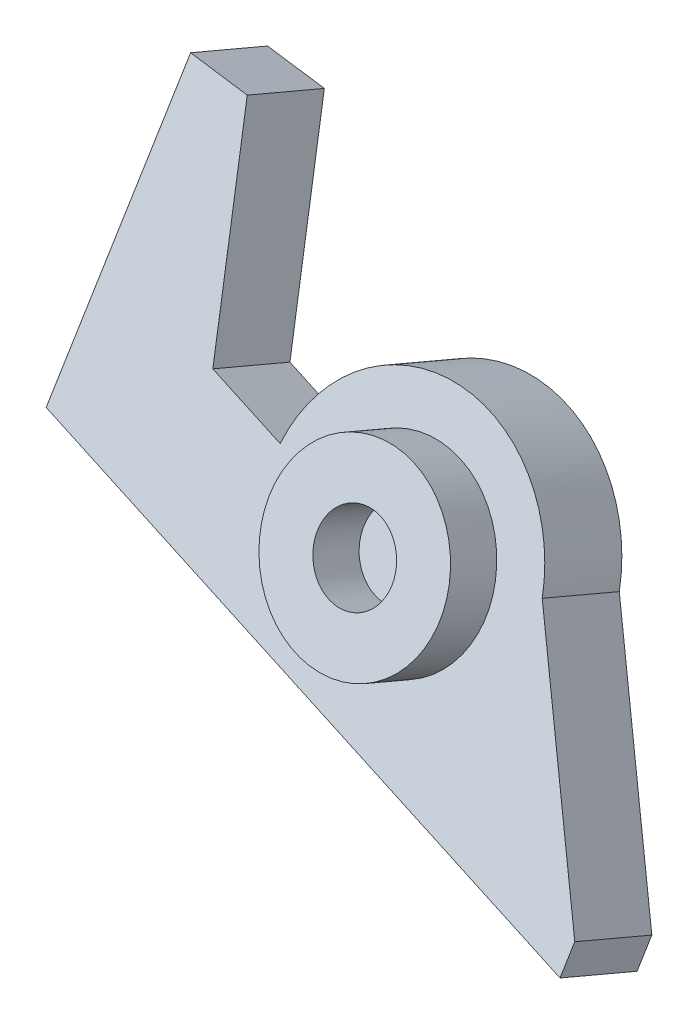
ISO-10303-21;
HEADER;
FILE_DESCRIPTION(('STEP AP214'),'2;1');
FILE_NAME('part.step','',(''),(''),'','','');
FILE_SCHEMA(('AUTOMOTIVE_DESIGN { 1 0 10303 214 1 1 1 1 }'));
ENDSEC;
DATA;
#1=APPLICATION_CONTEXT('core data for automotive mechanical design processes');
#2=APPLICATION_PROTOCOL_DEFINITION('international standard','automotive_design',2000,#1);
#3=PRODUCT_CONTEXT('',#1,'mechanical');
#4=PRODUCT('Part','Part','',(#3));
#5=PRODUCT_RELATED_PRODUCT_CATEGORY('part','',(#4));
#6=PRODUCT_DEFINITION_FORMATION('','',#4);
#7=PRODUCT_DEFINITION_CONTEXT('part definition',#1,'design');
#8=PRODUCT_DEFINITION('design','',#6,#7);
#9=PRODUCT_DEFINITION_SHAPE('','',#8);
#10=(LENGTH_UNIT() NAMED_UNIT(*) SI_UNIT(.MILLI.,.METRE.));
#11=(NAMED_UNIT(*) PLANE_ANGLE_UNIT() SI_UNIT($,.RADIAN.));
#12=(NAMED_UNIT(*) SI_UNIT($,.STERADIAN.) SOLID_ANGLE_UNIT());
#13=UNCERTAINTY_MEASURE_WITH_UNIT(LENGTH_MEASURE(1.E-05),#10,'distance_accuracy_value','');
#14=(GEOMETRIC_REPRESENTATION_CONTEXT(3) GLOBAL_UNCERTAINTY_ASSIGNED_CONTEXT((#13)) GLOBAL_UNIT_ASSIGNED_CONTEXT((#10,
#11,#12)) REPRESENTATION_CONTEXT('',''));
#15=CARTESIAN_POINT('',(0.,0.,0.));
#16=DIRECTION('',(0.,0.,1.));
#17=DIRECTION('',(1.,0.,0.));
#18=AXIS2_PLACEMENT_3D('',#15,#16,#17);
#19=CARTESIAN_POINT('',(14.8125805376239,-8.48935887369528,308.826969749882));
#20=DIRECTION('',(-0.994161271701165,0.0993265508240584,-0.0421616194057797));
#21=DIRECTION('',(-0.0994149502409714,-0.995046063088833,0.));
#22=AXIS2_PLACEMENT_3D('',#19,#20,#21);
#23=PLANE('',#22);
#24=DIRECTION('',(0.107904429239592,0.915130275715367,-0.388449755592142));
#25=VECTOR('',#24,1.);
#26=CARTESIAN_POINT('',(14.8125805376239,-10.4430145161416,304.22444548262));
#27=LINE('',#26,#25);
#28=CARTESIAN_POINT('',(14.6209854962964,-12.0679192974498,304.914176641024));
#29=VERTEX_POINT('',#28);
#30=CARTESIAN_POINT('',(14.8125805376239,-10.4430145161416,304.22444548262));
#31=VERTEX_POINT('',#30);
#32=EDGE_CURVE('E138',#29,#31,#27,.T.);
#33=ORIENTED_EDGE('',*,*,#32,.T.);
#34=DIRECTION('',(0.,-0.390731128489272,-0.920504853452441));
#35=VECTOR('',#34,1.);
#36=CARTESIAN_POINT('',(14.8125805376239,-8.48935887369528,308.826969749882));
#37=LINE('',#36,#35);
#38=CARTESIAN_POINT('',(14.8125805376239,-8.48935887369528,308.826969749882));
#39=VERTEX_POINT('',#38);
#40=EDGE_CURVE('E49',#39,#31,#37,.T.);
#41=ORIENTED_EDGE('',*,*,#40,.F.);
#42=DIRECTION('',(0.107904429239592,0.915130275715367,-0.388449755592142));
#43=VECTOR('',#42,1.);
#44=CARTESIAN_POINT('',(14.8125805376239,-8.48935887369528,308.826969749882));
#45=LINE('',#44,#43);
#46=CARTESIAN_POINT('',(14.6209854962964,-10.1142636550035,309.516700908286));
#47=VERTEX_POINT('',#46);
#48=EDGE_CURVE('E153',#47,#39,#45,.T.);
#49=ORIENTED_EDGE('',*,*,#48,.F.);
#50=DIRECTION('',(0.,-0.390731128489272,-0.920504853452441));
#51=VECTOR('',#50,1.);
#52=CARTESIAN_POINT('',(14.6209854962964,-10.1142636550035,309.516700908286));
#53=LINE('',#52,#51);
#54=EDGE_CURVE('E134',#47,#29,#53,.T.);
#55=ORIENTED_EDGE('',*,*,#54,.T.);
#56=EDGE_LOOP('',(#33,#41,#49,#55));
#57=FACE_BOUND('',#56,.T.);
#58=ADVANCED_FACE('F41',(#57),#23,.F.);
#59=CARTESIAN_POINT('',(7.86559114317784,3.29791646067198,303.823568218714));
#60=DIRECTION('',(-0.87898063015439,-0.438949620480405,0.186323059478691));
#61=DIRECTION('',(0.446773275951896,-0.894647215328596,0.));
#62=AXIS2_PLACEMENT_3D('',#59,#60,#61);
#63=PLANE('',#62);
#64=DIRECTION('',(-0.476857475367003,0.809105936147801,-0.343445093540436));
#65=VECTOR('',#64,1.);
#66=CARTESIAN_POINT('',(7.86559114317786,1.34426081822563,299.221043951452));
#67=LINE('',#66,#65);
#68=CARTESIAN_POINT('',(7.86559114317762,1.3442608182256,299.221043951452));
#69=VERTEX_POINT('',#68);
#70=EDGE_CURVE('E141',#31,#69,#67,.T.);
#71=ORIENTED_EDGE('',*,*,#70,.T.);
#72=DIRECTION('',(0.,-0.390731128489272,-0.920504853452441));
#73=VECTOR('',#72,1.);
#74=CARTESIAN_POINT('',(7.86559114317761,3.29791646067196,303.823568218714));
#75=LINE('',#74,#73);
#76=CARTESIAN_POINT('',(7.86559114317761,3.29791646067196,303.823568218714));
#77=VERTEX_POINT('',#76);
#78=EDGE_CURVE('E163',#77,#69,#75,.T.);
#79=ORIENTED_EDGE('',*,*,#78,.F.);
#80=DIRECTION('',(-0.476857475367003,0.809105936147801,-0.343445093540436));
#81=VECTOR('',#80,1.);
#82=CARTESIAN_POINT('',(7.86559114317784,3.29791646067198,303.823568218714));
#83=LINE('',#82,#81);
#84=EDGE_CURVE('E101',#39,#77,#83,.T.);
#85=ORIENTED_EDGE('',*,*,#84,.F.);
#86=ORIENTED_EDGE('',*,*,#40,.T.);
#87=EDGE_LOOP('',(#71,#79,#85,#86));
#88=FACE_BOUND('',#87,.T.);
#89=ADVANCED_FACE('F166',(#88),#63,.F.);
#90=CARTESIAN_POINT('',(-1.39659253553726E-13,1.95370326151105,304.394152869375));
#91=DIRECTION('',(0.,-0.390731128489272,-0.920504853452441));
#92=DIRECTION('',(0.,0.920504853452441,-0.390731128489272));
#93=AXIS2_PLACEMENT_3D('',#90,#91,#92);
#94=CYLINDRICAL_SURFACE('',#93,8.00000000000023);
#95=CARTESIAN_POINT('',(-1.2220184685951E-13,4.76190646914176E-05,299.791628602112));
#96=DIRECTION('',(0.,0.390731128489272,0.920504853452441));
#97=DIRECTION('',(0.,-0.920504853452441,0.390731128489272));
#98=AXIS2_PLACEMENT_3D('',#95,#96,#97);
#99=CIRCLE('',#98,8.00000000000023);
#100=CARTESIAN_POINT('',(-7.8393144027153,1.46857736601409,299.168274707678));
#101=VERTEX_POINT('',#100);
#102=EDGE_CURVE('E144',#69,#101,#99,.T.);
#103=ORIENTED_EDGE('',*,*,#102,.T.);
#104=DIRECTION('',(0.,-0.390731128489272,-0.920504853452441));
#105=VECTOR('',#104,1.);
#106=CARTESIAN_POINT('',(-7.83931440271532,3.42223300846045,303.77079897494));
#107=LINE('',#106,#105);
#108=CARTESIAN_POINT('',(-7.83931440271532,3.42223300846045,303.77079897494));
#109=VERTEX_POINT('',#108);
#110=EDGE_CURVE('E160',#109,#101,#107,.T.);
#111=ORIENTED_EDGE('',*,*,#110,.F.);
#112=CARTESIAN_POINT('',(-1.39659253553726E-13,1.95370326151105,304.394152869375));
#113=DIRECTION('',(0.,0.390731128489272,0.920504853452441));
#114=DIRECTION('',(0.,-0.920504853452441,0.390731128489272));
#115=AXIS2_PLACEMENT_3D('',#112,#113,#114);
#116=CIRCLE('',#115,8.00000000000023);
#117=EDGE_CURVE('E184',#77,#109,#116,.T.);
#118=ORIENTED_EDGE('',*,*,#117,.F.);
#119=ORIENTED_EDGE('',*,*,#78,.T.);
#120=EDGE_LOOP('',(#103,#111,#118,#119));
#121=FACE_BOUND('',#120,.T.);
#122=ADVANCED_FACE('F177',(#121),#94,.T.);
#123=CARTESIAN_POINT('',(-12.4126653241043,4.72505991857454,303.217781761716));
#124=DIRECTION('',(-0.295641511693019,-0.879357326088254,0.373265039373878));
#125=DIRECTION('',(0.,-0.390731128489271,-0.920504853452442));
#126=AXIS2_PLACEMENT_3D('',#123,#124,#125);
#127=PLANE('',#126);
#128=DIRECTION('',(-0.955298956643347,0.272139446395441,-0.115516341492086));
#129=VECTOR('',#128,1.);
#130=CARTESIAN_POINT('',(-12.4126653241042,2.77140427612818,298.615257494454));
#131=LINE('',#130,#129);
#132=CARTESIAN_POINT('',(-12.4126653241042,2.77140427612818,298.615257494454));
#133=VERTEX_POINT('',#132);
#134=EDGE_CURVE('E146',#101,#133,#131,.T.);
#135=ORIENTED_EDGE('',*,*,#134,.T.);
#136=DIRECTION('',(0.,-0.390731128489272,-0.920504853452441));
#137=VECTOR('',#136,1.);
#138=CARTESIAN_POINT('',(-12.4126653241043,4.72505991857454,303.217781761716));
#139=LINE('',#138,#137);
#140=CARTESIAN_POINT('',(-12.4126653241043,4.72505991857454,303.217781761716));
#141=VERTEX_POINT('',#140);
#142=EDGE_CURVE('E157',#141,#133,#139,.T.);
#143=ORIENTED_EDGE('',*,*,#142,.F.);
#144=DIRECTION('',(-0.955298956643347,0.272139446395441,-0.115516341492086));
#145=VECTOR('',#144,1.);
#146=CARTESIAN_POINT('',(-12.4126653241043,4.72505991857454,303.217781761716));
#147=LINE('',#146,#145);
#148=EDGE_CURVE('E183',#109,#141,#147,.T.);
#149=ORIENTED_EDGE('',*,*,#148,.F.);
#150=ORIENTED_EDGE('',*,*,#110,.T.);
#151=EDGE_LOOP('',(#135,#143,#149,#150));
#152=FACE_BOUND('',#151,.T.);
#153=ADVANCED_FACE('F181',(#152),#127,.F.);
#154=CARTESIAN_POINT('',(-14.8812929025772,15.3857892239627,298.692570649151));
#155=DIRECTION('',(-0.978028487517335,-0.19189883171222,0.0814562213218783));
#156=DIRECTION('',(0.192538652948244,-0.981289390099004,0.));
#157=AXIS2_PLACEMENT_3D('',#154,#155,#156);
#158=PLANE('',#157);
#159=DIRECTION('',(-0.208471287242521,0.900279969574456,-0.382146174622307));
#160=VECTOR('',#159,1.);
#161=CARTESIAN_POINT('',(-14.8812929025772,13.4321335815163,294.090046381889));
#162=LINE('',#161,#160);
#163=CARTESIAN_POINT('',(-14.8812929025772,13.4321335815163,294.090046381889));
#164=VERTEX_POINT('',#163);
#165=EDGE_CURVE('E148',#133,#164,#162,.T.);
#166=ORIENTED_EDGE('',*,*,#165,.T.);
#167=DIRECTION('',(0.,-0.390731128489272,-0.920504853452441));
#168=VECTOR('',#167,1.);
#169=CARTESIAN_POINT('',(-14.8812929025772,15.3857892239627,298.692570649151));
#170=LINE('',#169,#168);
#171=CARTESIAN_POINT('',(-14.8812929025772,15.3857892239627,298.692570649151));
#172=VERTEX_POINT('',#171);
#173=EDGE_CURVE('E129',#172,#164,#170,.T.);
#174=ORIENTED_EDGE('',*,*,#173,.F.);
#175=DIRECTION('',(-0.208471287242521,0.900279969574456,-0.382146174622307));
#176=VECTOR('',#175,1.);
#177=CARTESIAN_POINT('',(-14.8812929025772,15.3857892239627,298.692570649151));
#178=LINE('',#177,#176);
#179=EDGE_CURVE('E120',#141,#172,#178,.T.);
#180=ORIENTED_EDGE('',*,*,#179,.F.);
#181=ORIENTED_EDGE('',*,*,#142,.T.);
#182=EDGE_LOOP('',(#166,#174,#180,#181));
#183=FACE_BOUND('',#182,.T.);
#184=ADVANCED_FACE('F229',(#183),#158,.F.);
#185=CARTESIAN_POINT('',(-18.4128173068375,15.7386234654594,298.54280139934));
#186=DIRECTION('',(-0.107904429239589,-0.915130275715374,0.388449755592125));
#187=DIRECTION('',(0.,-0.390731128489271,-0.920504853452441));
#188=AXIS2_PLACEMENT_3D('',#185,#186,#187);
#189=PLANE('',#188);
#190=DIRECTION('',(-0.994161271701166,0.0993265508240564,-0.0421616194057765));
#191=VECTOR('',#190,1.);
#192=CARTESIAN_POINT('',(-18.4128173068375,13.7849678230131,293.940277132077));
#193=LINE('',#192,#191);
#194=CARTESIAN_POINT('',(-18.4128173068375,13.7849678230131,293.940277132077));
#195=VERTEX_POINT('',#194);
#196=EDGE_CURVE('E128',#164,#195,#193,.T.);
#197=ORIENTED_EDGE('',*,*,#196,.T.);
#198=DIRECTION('',(0.,-0.390731128489272,-0.920504853452441));
#199=VECTOR('',#198,1.);
#200=CARTESIAN_POINT('',(-18.4128173068375,15.7386234654594,298.54280139934));
#201=LINE('',#200,#199);
#202=CARTESIAN_POINT('',(-18.4128173068375,15.7386234654594,298.54280139934));
#203=VERTEX_POINT('',#202);
#204=EDGE_CURVE('E125',#203,#195,#201,.T.);
#205=ORIENTED_EDGE('',*,*,#204,.F.);
#206=DIRECTION('',(-0.994161271701166,0.0993265508240564,-0.0421616194057765));
#207=VECTOR('',#206,1.);
#208=CARTESIAN_POINT('',(-18.4128173068375,15.7386234654594,298.54280139934));
#209=LINE('',#208,#207);
#210=EDGE_CURVE('E114',#172,#203,#209,.T.);
#211=ORIENTED_EDGE('',*,*,#210,.F.);
#212=ORIENTED_EDGE('',*,*,#173,.T.);
#213=EDGE_LOOP('',(#197,#205,#211,#212));
#214=FACE_BOUND('',#213,.T.);
#215=ADVANCED_FACE('F126',(#214),#189,.F.);
#216=CARTESIAN_POINT('',(-18.4128173068375,15.7386234654594,298.54280139934));
#217=DIRECTION('',(0.994161271701165,-0.0993265508240594,0.0421616194057801));
#218=DIRECTION('',(0.0994149502409724,0.995046063088832,0.));
#219=AXIS2_PLACEMENT_3D('',#216,#217,#218);
#220=PLANE('',#219);
#221=DIRECTION('',(-0.107904429239593,-0.915130275715374,0.388449755592125));
#222=VECTOR('',#221,1.);
#223=CARTESIAN_POINT('',(-18.4128173068375,13.7849678230131,293.940277132077));
#224=LINE('',#223,#222);
#225=CARTESIAN_POINT('',(-20.2885634953037,-2.12311063789697,300.69285581302));
#226=VERTEX_POINT('',#225);
#227=EDGE_CURVE('E86',#195,#226,#224,.T.);
#228=ORIENTED_EDGE('',*,*,#227,.T.);
#229=DIRECTION('',(0.,-0.390731128489272,-0.920504853452441));
#230=VECTOR('',#229,1.);
#231=CARTESIAN_POINT('',(-20.2885634953037,-0.169454995450611,305.295380080282));
#232=LINE('',#231,#230);
#233=CARTESIAN_POINT('',(-20.2885634953037,-0.169454995450611,305.295380080282));
#234=VERTEX_POINT('',#233);
#235=EDGE_CURVE('E130',#234,#226,#232,.T.);
#236=ORIENTED_EDGE('',*,*,#235,.F.);
#237=DIRECTION('',(-0.107904429239593,-0.915130275715374,0.388449755592125));
#238=VECTOR('',#237,1.);
#239=CARTESIAN_POINT('',(-18.4128173068375,15.7386234654594,298.54280139934));
#240=LINE('',#239,#238);
#241=EDGE_CURVE('E118',#203,#234,#240,.T.);
#242=ORIENTED_EDGE('',*,*,#241,.F.);
#243=ORIENTED_EDGE('',*,*,#204,.T.);
#244=EDGE_LOOP('',(#228,#236,#242,#243));
#245=FACE_BOUND('',#244,.T.);
#246=ADVANCED_FACE('F132',(#245),#220,.F.);
#247=CARTESIAN_POINT('',(-20.2885634953037,-0.169454995450611,305.295380080282));
#248=DIRECTION('',(0.29564151169302,0.879357326088254,-0.373265039373877));
#249=DIRECTION('',(0.,0.390731128489271,0.920504853452442));
#250=AXIS2_PLACEMENT_3D('',#247,#248,#249);
#251=PLANE('',#250);
#252=DIRECTION('',(0.955298956643346,-0.27213944639544,0.115516341492092));
#253=VECTOR('',#252,1.);
#254=CARTESIAN_POINT('',(-20.2885634953037,-2.12311063789697,300.69285581302));
#255=LINE('',#254,#253);
#256=EDGE_CURVE('E92',#226,#29,#255,.T.);
#257=ORIENTED_EDGE('',*,*,#256,.T.);
#258=ORIENTED_EDGE('',*,*,#54,.F.);
#259=DIRECTION('',(0.955298956643346,-0.27213944639544,0.115516341492092));
#260=VECTOR('',#259,1.);
#261=CARTESIAN_POINT('',(-20.2885634953037,-0.169454995450611,305.295380080282));
#262=LINE('',#261,#260);
#263=EDGE_CURVE('E57',#234,#47,#262,.T.);
#264=ORIENTED_EDGE('',*,*,#263,.F.);
#265=ORIENTED_EDGE('',*,*,#235,.T.);
#266=EDGE_LOOP('',(#257,#258,#264,#265));
#267=FACE_BOUND('',#266,.T.);
#268=ADVANCED_FACE('F237',(#267),#251,.F.);
#269=CARTESIAN_POINT('',(-1.39659253553726E-13,1.95370326151105,304.394152869375));
#270=DIRECTION('',(0.,0.390731128489272,0.920504853452441));
#271=DIRECTION('',(0.,-0.920504853452441,0.390731128489272));
#272=AXIS2_PLACEMENT_3D('',#269,#270,#271);
#273=PLANE('',#272);
#274=CARTESIAN_POINT('',(-1.39659253553726E-13,1.95370326151106,304.394152869375));
#275=DIRECTION('',(0.,0.390731128489272,0.920504853452441));
#276=DIRECTION('',(0.,-0.920504853452441,0.390731128489272));
#277=AXIS2_PLACEMENT_3D('',#274,#275,#276);
#278=CIRCLE('',#277,5.32909842305853);
#279=CARTESIAN_POINT('',(-1.39659253553726E-13,-2.95175770144006,306.476397510047));
#280=VERTEX_POINT('',#279);
#281=EDGE_CURVE('E190',#280,#280,#278,.T.);
#282=ORIENTED_EDGE('',*,*,#281,.F.);
#283=EDGE_LOOP('',(#282));
#284=FACE_BOUND('',#283,.T.);
#285=ORIENTED_EDGE('',*,*,#48,.T.);
#286=ORIENTED_EDGE('',*,*,#84,.T.);
#287=ORIENTED_EDGE('',*,*,#117,.T.);
#288=ORIENTED_EDGE('',*,*,#148,.T.);
#289=ORIENTED_EDGE('',*,*,#179,.T.);
#290=ORIENTED_EDGE('',*,*,#210,.T.);
#291=ORIENTED_EDGE('',*,*,#241,.T.);
#292=ORIENTED_EDGE('',*,*,#263,.T.);
#293=EDGE_LOOP('',(#285,#286,#287,#288,#289,#290,#291,#292));
#294=FACE_BOUND('',#293,.T.);
#295=ADVANCED_FACE('F116',(#284,#294),#273,.T.);
#296=CARTESIAN_POINT('',(-1.2220184685951E-13,4.76190646914176E-05,299.791628602112));
#297=DIRECTION('',(0.,0.390731128489272,0.920504853452441));
#298=DIRECTION('',(0.,-0.920504853452441,0.390731128489272));
#299=AXIS2_PLACEMENT_3D('',#296,#297,#298);
#300=PLANE('',#299);
#301=ORIENTED_EDGE('',*,*,#32,.F.);
#302=ORIENTED_EDGE('',*,*,#256,.F.);
#303=ORIENTED_EDGE('',*,*,#227,.F.);
#304=ORIENTED_EDGE('',*,*,#196,.F.);
#305=ORIENTED_EDGE('',*,*,#165,.F.);
#306=ORIENTED_EDGE('',*,*,#134,.F.);
#307=ORIENTED_EDGE('',*,*,#102,.F.);
#308=ORIENTED_EDGE('',*,*,#70,.F.);
#309=EDGE_LOOP('',(#301,#302,#303,#304,#305,#306,#307,#308));
#310=FACE_BOUND('',#309,.T.);
#311=ADVANCED_FACE('F171',(#310),#300,.F.);
#312=CARTESIAN_POINT('',(-1.50133697570255E-13,3.12589664697888,307.155667429732));
#313=DIRECTION('',(0.,0.390731128489272,0.920504853452441));
#314=DIRECTION('',(0.,-0.920504853452441,0.390731128489272));
#315=AXIS2_PLACEMENT_3D('',#312,#313,#314);
#316=PLANE('',#315);
#317=CARTESIAN_POINT('',(-1.50133697570255E-13,3.12589664697888,307.155667429732));
#318=DIRECTION('',(0.,0.390731128489272,0.920504853452441));
#319=DIRECTION('',(0.,-0.920504853452441,0.390731128489272));
#320=AXIS2_PLACEMENT_3D('',#317,#318,#319);
#321=CIRCLE('',#320,5.32909842305853);
#322=CARTESIAN_POINT('',(-1.50133697570255E-13,-1.77956431597225,309.237912070404));
#323=VERTEX_POINT('',#322);
#324=EDGE_CURVE('E142',#323,#323,#321,.T.);
#325=ORIENTED_EDGE('',*,*,#324,.T.);
#326=EDGE_LOOP('',(#325));
#327=FACE_BOUND('',#326,.T.);
#328=CARTESIAN_POINT('',(-1.50133697570255E-13,3.12589664697888,307.155667429732));
#329=DIRECTION('',(0.,0.390731128489272,0.920504853452441));
#330=DIRECTION('',(1.,0.,0.));
#331=AXIS2_PLACEMENT_3D('',#328,#329,#330);
#332=CIRCLE('',#331,2.32909842305853);
#333=CARTESIAN_POINT('',(2.32909842305838,3.12589664697888,307.155667429732));
#334=VERTEX_POINT('',#333);
#335=EDGE_CURVE('E193',#334,#334,#332,.T.);
#336=ORIENTED_EDGE('',*,*,#335,.F.);
#337=EDGE_LOOP('',(#336));
#338=FACE_BOUND('',#337,.T.);
#339=ADVANCED_FACE('F202',(#327,#338),#316,.T.);
#340=CARTESIAN_POINT('',(-1.50133697570255E-13,3.12589664697888,307.155667429732));
#341=DIRECTION('',(0.,-0.390731128489271,-0.920504853452441));
#342=DIRECTION('',(0.,0.920504853452441,-0.390731128489272));
#343=AXIS2_PLACEMENT_3D('',#340,#341,#342);
#344=CYLINDRICAL_SURFACE('',#343,5.32909842305853);
#345=ORIENTED_EDGE('',*,*,#324,.F.);
#346=EDGE_LOOP('',(#345));
#347=FACE_BOUND('',#346,.T.);
#348=ORIENTED_EDGE('',*,*,#281,.T.);
#349=EDGE_LOOP('',(#348));
#350=FACE_BOUND('',#349,.T.);
#351=ADVANCED_FACE('F204',(#347,#350),#344,.T.);
#352=CARTESIAN_POINT('',(-1.50133697570255E-13,3.12589664697888,307.155667429732));
#353=DIRECTION('',(0.,-0.390731128489271,-0.920504853452441));
#354=DIRECTION('',(0.,0.920504853452441,-0.390731128489272));
#355=AXIS2_PLACEMENT_3D('',#352,#353,#354);
#356=CYLINDRICAL_SURFACE('',#355,2.32909842305853);
#357=ORIENTED_EDGE('',*,*,#335,.T.);
#358=EDGE_LOOP('',(#357));
#359=FACE_BOUND('',#358,.T.);
#360=CARTESIAN_POINT('',(-1.39659253553725E-13,1.95370326151102,304.394152869375));
#361=DIRECTION('',(0.,0.390731128489272,0.920504853452441));
#362=DIRECTION('',(0.,-0.920504853452441,0.390731128489272));
#363=AXIS2_PLACEMENT_3D('',#360,#361,#362);
#364=CIRCLE('',#363,2.32909842305853);
#365=CARTESIAN_POINT('',(-1.39659253553725E-13,-0.190243141082787,305.304204124579));
#366=VERTEX_POINT('',#365);
#367=EDGE_CURVE('E11',#366,#366,#364,.F.);
#368=ORIENTED_EDGE('',*,*,#367,.T.);
#369=EDGE_LOOP('',(#368));
#370=FACE_BOUND('',#369,.T.);
#371=ADVANCED_FACE('F199',(#359,#370),#356,.F.);
#372=ORIENTED_EDGE('',*,*,#367,.F.);
#373=EDGE_LOOP('',(#372));
#374=FACE_BOUND('',#373,.T.);
#375=ADVANCED_FACE('F242',(#374),#273,.T.);
#376=CLOSED_SHELL('',(#58,#89,#122,#153,#184,#215,#246,#268,#295,#311,#339,#351,#371,#375));
#377=MANIFOLD_SOLID_BREP('B2',#376);
#378=ADVANCED_BREP_SHAPE_REPRESENTATION('',(#18,#377),#14);
#379=SHAPE_DEFINITION_REPRESENTATION(#9,#378);
ENDSEC;
END-ISO-10303-21;
